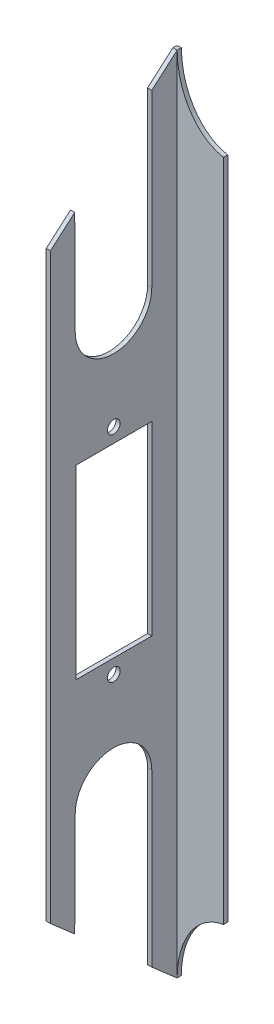
ISO-10303-21;
HEADER;
FILE_DESCRIPTION(('STEP AP214'),'2;1');
FILE_NAME('part.step','',(''),(''),'','','');
FILE_SCHEMA(('AUTOMOTIVE_DESIGN { 1 0 10303 214 1 1 1 1 }'));
ENDSEC;
DATA;
#1=APPLICATION_CONTEXT('core data for automotive mechanical design processes');
#2=APPLICATION_PROTOCOL_DEFINITION('international standard','automotive_design',2000,#1);
#3=PRODUCT_CONTEXT('',#1,'mechanical');
#4=PRODUCT('Part','Part','',(#3));
#5=PRODUCT_RELATED_PRODUCT_CATEGORY('part','',(#4));
#6=PRODUCT_DEFINITION_FORMATION('','',#4);
#7=PRODUCT_DEFINITION_CONTEXT('part definition',#1,'design');
#8=PRODUCT_DEFINITION('design','',#6,#7);
#9=PRODUCT_DEFINITION_SHAPE('','',#8);
#10=(LENGTH_UNIT() NAMED_UNIT(*) SI_UNIT(.MILLI.,.METRE.));
#11=(NAMED_UNIT(*) PLANE_ANGLE_UNIT() SI_UNIT($,.RADIAN.));
#12=(NAMED_UNIT(*) SI_UNIT($,.STERADIAN.) SOLID_ANGLE_UNIT());
#13=UNCERTAINTY_MEASURE_WITH_UNIT(LENGTH_MEASURE(1.E-05),#10,'distance_accuracy_value','');
#14=(GEOMETRIC_REPRESENTATION_CONTEXT(3) GLOBAL_UNCERTAINTY_ASSIGNED_CONTEXT((#13)) GLOBAL_UNIT_ASSIGNED_CONTEXT((#10,
#11,#12)) REPRESENTATION_CONTEXT('',''));
#15=CARTESIAN_POINT('',(0.,0.,0.));
#16=DIRECTION('',(0.,0.,1.));
#17=DIRECTION('',(1.,0.,0.));
#18=AXIS2_PLACEMENT_3D('',#15,#16,#17);
#19=CARTESIAN_POINT('',(906.5,-613.964402389266,535.434071851104));
#20=DIRECTION('',(0.,-0.753661415709483,0.65726286253734));
#21=DIRECTION('',(0.,-0.65726286253734,-0.753661415709483));
#22=AXIS2_PLACEMENT_3D('',#19,#20,#21);
#23=PLANE('',#22);
#24=DIRECTION('',(0.,-0.65726286253734,-0.753661415709483));
#25=VECTOR('',#24,1.);
#26=CARTESIAN_POINT('',(906.5,-613.964402389266,535.434071851104));
#27=LINE('',#26,#25);
#28=CARTESIAN_POINT('',(906.5,-68.9811056315042,1160.34825213334));
#29=VERTEX_POINT('',#28);
#30=CARTESIAN_POINT('',(906.5,-73.9946501548774,1154.59938774655));
#31=VERTEX_POINT('',#30);
#32=EDGE_CURVE('E277',#29,#31,#27,.T.);
#33=ORIENTED_EDGE('',*,*,#32,.T.);
#34=DIRECTION('',(-1.,0.,0.));
#35=VECTOR('',#34,1.);
#36=CARTESIAN_POINT('',(907.5,-73.9946501548774,1154.59938774655));
#37=LINE('',#36,#35);
#38=CARTESIAN_POINT('',(907.5,-73.9946501548652,1154.59938774655));
#39=VERTEX_POINT('',#38);
#40=EDGE_CURVE('E200',#39,#31,#37,.T.);
#41=ORIENTED_EDGE('',*,*,#40,.F.);
#42=DIRECTION('',(0.,-0.65726286253734,-0.753661415709483));
#43=VECTOR('',#42,1.);
#44=CARTESIAN_POINT('',(907.5,-613.964402389266,535.434071851104));
#45=LINE('',#44,#43);
#46=CARTESIAN_POINT('',(907.5,-68.9811056315042,1160.34825213334));
#47=VERTEX_POINT('',#46);
#48=EDGE_CURVE('E214',#47,#39,#45,.T.);
#49=ORIENTED_EDGE('',*,*,#48,.F.);
#50=DIRECTION('',(1.,0.,0.));
#51=VECTOR('',#50,1.);
#52=CARTESIAN_POINT('',(906.5,-68.9811056315042,1160.34825213334));
#53=LINE('',#52,#51);
#54=EDGE_CURVE('E265',#29,#47,#53,.T.);
#55=ORIENTED_EDGE('',*,*,#54,.F.);
#56=EDGE_LOOP('',(#33,#41,#49,#55));
#57=FACE_BOUND('',#56,.T.);
#58=ADVANCED_FACE('F41',(#57),#23,.T.);
#59=CARTESIAN_POINT('',(906.5,613.964402389274,535.434071851114));
#60=DIRECTION('',(0.,-0.753661415709481,-0.657262862537342));
#61=DIRECTION('',(0.,0.657262862537342,-0.753661415709481));
#62=AXIS2_PLACEMENT_3D('',#59,#60,#61);
#63=PLANE('',#62);
#64=DIRECTION('',(-1.,0.,0.));
#65=VECTOR('',#64,1.);
#66=CARTESIAN_POINT('',(907.5,89.911338189656,1136.34825213334));
#67=LINE('',#66,#65);
#68=CARTESIAN_POINT('',(907.5,89.911338189656,1136.34825213334));
#69=VERTEX_POINT('',#68);
#70=CARTESIAN_POINT('',(906.5,89.911338189656,1136.34825213334));
#71=VERTEX_POINT('',#70);
#72=EDGE_CURVE('E598',#69,#71,#67,.T.);
#73=ORIENTED_EDGE('',*,*,#72,.F.);
#74=DIRECTION('',(0.,0.657262862537342,-0.753661415709481));
#75=VECTOR('',#74,1.);
#76=CARTESIAN_POINT('',(907.5,613.964402389274,535.434071851114));
#77=LINE('',#76,#75);
#78=CARTESIAN_POINT('',(907.5,95.1438963291906,1130.34825213334));
#79=VERTEX_POINT('',#78);
#80=EDGE_CURVE('E227',#69,#79,#77,.T.);
#81=ORIENTED_EDGE('',*,*,#80,.T.);
#82=DIRECTION('',(1.,0.,0.));
#83=VECTOR('',#82,1.);
#84=CARTESIAN_POINT('',(906.5,95.1438963291911,1130.34825213334));
#85=LINE('',#84,#83);
#86=CARTESIAN_POINT('',(906.5,95.1438963291911,1130.34825213334));
#87=VERTEX_POINT('',#86);
#88=EDGE_CURVE('E260',#87,#79,#85,.T.);
#89=ORIENTED_EDGE('',*,*,#88,.F.);
#90=DIRECTION('',(0.,0.657262862537342,-0.753661415709481));
#91=VECTOR('',#90,1.);
#92=CARTESIAN_POINT('',(906.5,613.964402389274,535.434071851114));
#93=LINE('',#92,#91);
#94=EDGE_CURVE('E283',#71,#87,#93,.T.);
#95=ORIENTED_EDGE('',*,*,#94,.F.);
#96=EDGE_LOOP('',(#73,#81,#89,#95));
#97=FACE_BOUND('',#96,.T.);
#98=ADVANCED_FACE('F338',(#97),#63,.F.);
#99=CARTESIAN_POINT('',(906.5,0.,0.));
#100=DIRECTION('',(-1.,0.,0.));
#101=DIRECTION('',(0.,0.,1.));
#102=AXIS2_PLACEMENT_3D('',#99,#100,#101);
#103=PLANE('',#102);
#104=DIRECTION('',(0.,-1.,0.));
#105=VECTOR('',#104,1.);
#106=CARTESIAN_POINT('',(906.5,0.,1136.34825213334));
#107=LINE('',#106,#105);
#108=CARTESIAN_POINT('',(906.5,-49.4661870834936,1136.34825213334));
#109=VERTEX_POINT('',#108);
#110=CARTESIAN_POINT('',(906.5,-89.911338189656,1136.34825213334));
#111=VERTEX_POINT('',#110);
#112=EDGE_CURVE('E196',#109,#111,#107,.T.);
#113=ORIENTED_EDGE('',*,*,#112,.F.);
#114=CARTESIAN_POINT('',(906.5,-49.4661870834936,1145.41453048203));
#115=DIRECTION('',(1.,0.,0.));
#116=DIRECTION('',(0.,0.,1.));
#117=AXIS2_PLACEMENT_3D('',#114,#115,#116);
#118=CIRCLE('',#117,9.06627834869233);
#119=CARTESIAN_POINT('',(906.5,-49.4223972165044,1154.4807030782));
#120=VERTEX_POINT('',#119);
#121=EDGE_CURVE('E208',#109,#120,#118,.T.);
#122=ORIENTED_EDGE('',*,*,#121,.T.);
#123=DIRECTION('',(0.,-0.999988335619117,0.00482997160522153));
#124=VECTOR('',#123,1.);
#125=CARTESIAN_POINT('',(906.5,5.57489101617828,1154.21506463916));
#126=LINE('',#125,#124);
#127=EDGE_CURVE('E734',#120,#31,#126,.T.);
#128=ORIENTED_EDGE('',*,*,#127,.T.);
#129=ORIENTED_EDGE('',*,*,#32,.F.);
#130=DIRECTION('',(0.,-1.,0.));
#131=VECTOR('',#130,1.);
#132=CARTESIAN_POINT('',(906.5,0.,1160.34825213334));
#133=LINE('',#132,#131);
#134=CARTESIAN_POINT('',(906.5,68.9811056315166,1160.34825213334));
#135=VERTEX_POINT('',#134);
#136=EDGE_CURVE('E280',#135,#29,#133,.T.);
#137=ORIENTED_EDGE('',*,*,#136,.F.);
#138=CARTESIAN_POINT('',(906.5,73.9946501548774,1154.59938774655));
#139=VERTEX_POINT('',#138);
#140=EDGE_CURVE('E284',#135,#139,#93,.T.);
#141=ORIENTED_EDGE('',*,*,#140,.T.);
#142=DIRECTION('',(0.,0.999988335619117,0.00482997160522153));
#143=VECTOR('',#142,1.);
#144=CARTESIAN_POINT('',(906.5,-5.57489101617828,1154.21506463916));
#145=LINE('',#144,#143);
#146=CARTESIAN_POINT('',(906.5,49.4223972165044,1154.4807030782));
#147=VERTEX_POINT('',#146);
#148=EDGE_CURVE('E713',#147,#139,#145,.T.);
#149=ORIENTED_EDGE('',*,*,#148,.F.);
#150=CARTESIAN_POINT('',(906.5,49.4661870834936,1145.41453048203));
#151=DIRECTION('',(-1.,0.,0.));
#152=DIRECTION('',(0.,0.,1.));
#153=AXIS2_PLACEMENT_3D('',#150,#151,#152);
#154=CIRCLE('',#153,9.06627834869233);
#155=CARTESIAN_POINT('',(906.5,49.4661870834936,1136.34825213334));
#156=VERTEX_POINT('',#155);
#157=EDGE_CURVE('E716',#156,#147,#154,.T.);
#158=ORIENTED_EDGE('',*,*,#157,.F.);
#159=DIRECTION('',(0.,1.,0.));
#160=VECTOR('',#159,1.);
#161=CARTESIAN_POINT('',(906.5,0.,1136.34825213334));
#162=LINE('',#161,#160);
#163=EDGE_CURVE('E719',#156,#71,#162,.T.);
#164=ORIENTED_EDGE('',*,*,#163,.T.);
#165=ORIENTED_EDGE('',*,*,#94,.T.);
#166=DIRECTION('',(0.,0.,1.));
#167=VECTOR('',#166,1.);
#168=CARTESIAN_POINT('',(906.5,95.1438963291906,1129.34825213334));
#169=LINE('',#168,#167);
#170=CARTESIAN_POINT('',(906.5,95.1438963291906,1129.84825213334));
#171=VERTEX_POINT('',#170);
#172=EDGE_CURVE('E628',#171,#87,#169,.T.);
#173=ORIENTED_EDGE('',*,*,#172,.F.);
#174=CARTESIAN_POINT('',(906.5,-104.658285962047,1129.84825213334));
#175=CARTESIAN_POINT('',(906.5,-34.8860953206626,1129.84825213334));
#176=CARTESIAN_POINT('',(906.5,34.8860953207221,1129.84825213334));
#177=CARTESIAN_POINT('',(906.5,104.658285962107,1129.84825213334));
#178=(BOUNDED_CURVE() B_SPLINE_CURVE(3,(#174,#175,#176,#177),.UNSPECIFIED.,.F.,
.F.) B_SPLINE_CURVE_WITH_KNOTS((4,4),(-0.198966238765806,0.0103503331583482),
.UNSPECIFIED.) CURVE() GEOMETRIC_REPRESENTATION_ITEM() RATIONAL_B_SPLINE_CURVE((1.,1.,1.,1.)) REPRESENTATION_ITEM(''));
#179=CARTESIAN_POINT('',(906.500000000001,-95.1438963291312,1129.84825213334));
#180=VERTEX_POINT('',#179);
#181=EDGE_CURVE('E55',#171,#180,#178,.F.);
#182=ORIENTED_EDGE('',*,*,#181,.T.);
#183=DIRECTION('',(0.,9.55069356933896E-11,-1.));
#184=VECTOR('',#183,1.);
#185=CARTESIAN_POINT('',(906.500000000001,-95.1438963291789,1130.34825213334));
#186=LINE('',#185,#184);
#187=CARTESIAN_POINT('',(906.5,-95.1438963291784,1130.34825213334));
#188=VERTEX_POINT('',#187);
#189=EDGE_CURVE('E624',#188,#180,#186,.T.);
#190=ORIENTED_EDGE('',*,*,#189,.F.);
#191=EDGE_CURVE('E249',#111,#188,#27,.T.);
#192=ORIENTED_EDGE('',*,*,#191,.F.);
#193=EDGE_LOOP('',(#113,#122,#128,#129,#137,#141,#149,#158,#164,#165,#173,#182,#190,#192));
#194=FACE_BOUND('',#193,.T.);
#195=CARTESIAN_POINT('',(906.5,-25.3999999999899,1145.34825213334));
#196=DIRECTION('',(-1.,0.,0.));
#197=DIRECTION('',(0.,0.,1.));
#198=AXIS2_PLACEMENT_3D('',#195,#196,#197);
#199=CIRCLE('',#198,1.50000000000008);
#200=CARTESIAN_POINT('',(906.5,-25.3999999999899,1146.84825213334));
#201=VERTEX_POINT('',#200);
#202=EDGE_CURVE('E287',#201,#201,#199,.T.);
#203=ORIENTED_EDGE('',*,*,#202,.F.);
#204=EDGE_LOOP('',(#203));
#205=FACE_BOUND('',#204,.T.);
#206=CARTESIAN_POINT('',(906.5,25.4000000000101,1145.34825213334));
#207=DIRECTION('',(-1.,0.,0.));
#208=DIRECTION('',(0.,0.,1.));
#209=AXIS2_PLACEMENT_3D('',#206,#207,#208);
#210=CIRCLE('',#209,1.50000000000008);
#211=CARTESIAN_POINT('',(906.5,25.4000000000101,1146.84825213334));
#212=VERTEX_POINT('',#211);
#213=EDGE_CURVE('E290',#212,#212,#210,.T.);
#214=ORIENTED_EDGE('',*,*,#213,.F.);
#215=EDGE_LOOP('',(#214));
#216=FACE_BOUND('',#215,.T.);
#217=DIRECTION('',(0.,-1.,0.));
#218=VECTOR('',#217,1.);
#219=CARTESIAN_POINT('',(906.5,0.,1136.34825213334));
#220=LINE('',#219,#218);
#221=CARTESIAN_POINT('',(906.5,22.0000000000101,1136.34825213334));
#222=VERTEX_POINT('',#221);
#223=CARTESIAN_POINT('',(906.5,-21.9999999999899,1136.34825213334));
#224=VERTEX_POINT('',#223);
#225=EDGE_CURVE('E293',#222,#224,#220,.T.);
#226=ORIENTED_EDGE('',*,*,#225,.F.);
#227=DIRECTION('',(0.,0.,-1.));
#228=VECTOR('',#227,1.);
#229=CARTESIAN_POINT('',(906.5,22.0000000000098,0.));
#230=LINE('',#229,#228);
#231=CARTESIAN_POINT('',(906.5,22.0000000000101,1154.34825213334));
#232=VERTEX_POINT('',#231);
#233=EDGE_CURVE('E296',#232,#222,#230,.T.);
#234=ORIENTED_EDGE('',*,*,#233,.F.);
#235=DIRECTION('',(0.,-1.,0.));
#236=VECTOR('',#235,1.);
#237=CARTESIAN_POINT('',(906.5,0.,1154.34825213334));
#238=LINE('',#237,#236);
#239=CARTESIAN_POINT('',(906.5,-21.9999999999899,1154.34825213334));
#240=VERTEX_POINT('',#239);
#241=EDGE_CURVE('E298',#232,#240,#238,.T.);
#242=ORIENTED_EDGE('',*,*,#241,.T.);
#243=DIRECTION('',(0.,0.,-1.));
#244=VECTOR('',#243,1.);
#245=CARTESIAN_POINT('',(906.5,-21.9999999999899,0.));
#246=LINE('',#245,#244);
#247=EDGE_CURVE('E223',#240,#224,#246,.T.);
#248=ORIENTED_EDGE('',*,*,#247,.T.);
#249=EDGE_LOOP('',(#226,#234,#242,#248));
#250=FACE_BOUND('',#249,.T.);
#251=ADVANCED_FACE('F306',(#194,#205,#216,#250),#103,.T.);
#252=CARTESIAN_POINT('',(907.5,0.,0.));
#253=DIRECTION('',(-1.,0.,0.));
#254=DIRECTION('',(0.,0.,1.));
#255=AXIS2_PLACEMENT_3D('',#252,#253,#254);
#256=PLANE('',#255);
#257=DIRECTION('',(0.,-1.,0.));
#258=VECTOR('',#257,1.);
#259=CARTESIAN_POINT('',(907.5,0.,1136.34825213334));
#260=LINE('',#259,#258);
#261=CARTESIAN_POINT('',(907.5,22.0000000000101,1136.34825213334));
#262=VERTEX_POINT('',#261);
#263=CARTESIAN_POINT('',(907.5,-21.9999999999899,1136.34825213334));
#264=VERTEX_POINT('',#263);
#265=EDGE_CURVE('E237',#262,#264,#260,.T.);
#266=ORIENTED_EDGE('',*,*,#265,.T.);
#267=DIRECTION('',(0.,0.,-1.));
#268=VECTOR('',#267,1.);
#269=CARTESIAN_POINT('',(907.5,-21.9999999999899,0.));
#270=LINE('',#269,#268);
#271=CARTESIAN_POINT('',(907.5,-21.9999999999899,1154.34825213334));
#272=VERTEX_POINT('',#271);
#273=EDGE_CURVE('E246',#272,#264,#270,.T.);
#274=ORIENTED_EDGE('',*,*,#273,.F.);
#275=DIRECTION('',(0.,-1.,0.));
#276=VECTOR('',#275,1.);
#277=CARTESIAN_POINT('',(907.5,0.,1154.34825213334));
#278=LINE('',#277,#276);
#279=CARTESIAN_POINT('',(907.5,22.0000000000101,1154.34825213334));
#280=VERTEX_POINT('',#279);
#281=EDGE_CURVE('E243',#280,#272,#278,.T.);
#282=ORIENTED_EDGE('',*,*,#281,.F.);
#283=DIRECTION('',(0.,0.,-1.));
#284=VECTOR('',#283,1.);
#285=CARTESIAN_POINT('',(907.5,22.0000000000098,0.));
#286=LINE('',#285,#284);
#287=EDGE_CURVE('E240',#280,#262,#286,.T.);
#288=ORIENTED_EDGE('',*,*,#287,.T.);
#289=EDGE_LOOP('',(#266,#274,#282,#288));
#290=FACE_BOUND('',#289,.T.);
#291=CARTESIAN_POINT('',(907.5,25.4000000000101,1145.34825213334));
#292=DIRECTION('',(-1.,0.,0.));
#293=DIRECTION('',(0.,0.,1.));
#294=AXIS2_PLACEMENT_3D('',#291,#292,#293);
#295=CIRCLE('',#294,1.50000000000008);
#296=CARTESIAN_POINT('',(907.5,25.4000000000101,1146.84825213334));
#297=VERTEX_POINT('',#296);
#298=EDGE_CURVE('E234',#297,#297,#295,.T.);
#299=ORIENTED_EDGE('',*,*,#298,.T.);
#300=EDGE_LOOP('',(#299));
#301=FACE_BOUND('',#300,.T.);
#302=CARTESIAN_POINT('',(907.5,-25.3999999999899,1145.34825213334));
#303=DIRECTION('',(-1.,0.,0.));
#304=DIRECTION('',(0.,0.,1.));
#305=AXIS2_PLACEMENT_3D('',#302,#303,#304);
#306=CIRCLE('',#305,1.50000000000008);
#307=CARTESIAN_POINT('',(907.5,-25.3999999999899,1146.84825213334));
#308=VERTEX_POINT('',#307);
#309=EDGE_CURVE('E231',#308,#308,#306,.T.);
#310=ORIENTED_EDGE('',*,*,#309,.T.);
#311=EDGE_LOOP('',(#310));
#312=FACE_BOUND('',#311,.T.);
#313=CARTESIAN_POINT('',(907.5,-49.4661870834936,1145.41453048203));
#314=DIRECTION('',(1.,0.,0.));
#315=DIRECTION('',(0.,0.,1.));
#316=AXIS2_PLACEMENT_3D('',#313,#314,#315);
#317=CIRCLE('',#316,9.06627834869233);
#318=CARTESIAN_POINT('',(907.5,-49.4661870834936,1136.34825213334));
#319=VERTEX_POINT('',#318);
#320=CARTESIAN_POINT('',(907.5,-49.4223972165044,1154.4807030782));
#321=VERTEX_POINT('',#320);
#322=EDGE_CURVE('E201',#319,#321,#317,.T.);
#323=ORIENTED_EDGE('',*,*,#322,.F.);
#324=DIRECTION('',(0.,-1.,0.));
#325=VECTOR('',#324,1.);
#326=CARTESIAN_POINT('',(907.5,0.,1136.34825213334));
#327=LINE('',#326,#325);
#328=CARTESIAN_POINT('',(907.5,-89.911338189656,1136.34825213334));
#329=VERTEX_POINT('',#328);
#330=EDGE_CURVE('E193',#319,#329,#327,.T.);
#331=ORIENTED_EDGE('',*,*,#330,.T.);
#332=CARTESIAN_POINT('',(907.5,-95.1438963291784,1130.34825213334));
#333=VERTEX_POINT('',#332);
#334=EDGE_CURVE('E206',#329,#333,#45,.T.);
#335=ORIENTED_EDGE('',*,*,#334,.T.);
#336=DIRECTION('',(0.,1.,0.));
#337=VECTOR('',#336,1.);
#338=CARTESIAN_POINT('',(907.5,95.1438963291911,1130.34825213334));
#339=LINE('',#338,#337);
#340=EDGE_CURVE('E608',#333,#79,#339,.T.);
#341=ORIENTED_EDGE('',*,*,#340,.T.);
#342=ORIENTED_EDGE('',*,*,#80,.F.);
#343=DIRECTION('',(0.,1.,0.));
#344=VECTOR('',#343,1.);
#345=CARTESIAN_POINT('',(907.5,0.,1136.34825213334));
#346=LINE('',#345,#344);
#347=CARTESIAN_POINT('',(907.5,49.4661870834936,1136.34825213334));
#348=VERTEX_POINT('',#347);
#349=EDGE_CURVE('E715',#348,#69,#346,.T.);
#350=ORIENTED_EDGE('',*,*,#349,.F.);
#351=CARTESIAN_POINT('',(907.5,49.4661870834936,1145.41453048203));
#352=DIRECTION('',(-1.,0.,0.));
#353=DIRECTION('',(0.,0.,1.));
#354=AXIS2_PLACEMENT_3D('',#351,#352,#353);
#355=CIRCLE('',#354,9.06627834869233);
#356=CARTESIAN_POINT('',(907.5,49.4223972165044,1154.4807030782));
#357=VERTEX_POINT('',#356);
#358=EDGE_CURVE('E724',#348,#357,#355,.T.);
#359=ORIENTED_EDGE('',*,*,#358,.T.);
#360=DIRECTION('',(0.,0.999988335619117,0.00482997160522153));
#361=VECTOR('',#360,1.);
#362=CARTESIAN_POINT('',(907.5,-5.57489101617828,1154.21506463916));
#363=LINE('',#362,#361);
#364=CARTESIAN_POINT('',(907.5,73.9946501548774,1154.59938774655));
#365=VERTEX_POINT('',#364);
#366=EDGE_CURVE('E70',#357,#365,#363,.T.);
#367=ORIENTED_EDGE('',*,*,#366,.T.);
#368=CARTESIAN_POINT('',(907.5,68.9811056315166,1160.34825213334));
#369=VERTEX_POINT('',#368);
#370=EDGE_CURVE('E228',#369,#365,#77,.T.);
#371=ORIENTED_EDGE('',*,*,#370,.F.);
#372=DIRECTION('',(0.,-1.,0.));
#373=VECTOR('',#372,1.);
#374=CARTESIAN_POINT('',(907.5,0.,1160.34825213334));
#375=LINE('',#374,#373);
#376=EDGE_CURVE('E218',#369,#47,#375,.T.);
#377=ORIENTED_EDGE('',*,*,#376,.T.);
#378=ORIENTED_EDGE('',*,*,#48,.T.);
#379=DIRECTION('',(0.,-0.999988335619117,0.00482997160522153));
#380=VECTOR('',#379,1.);
#381=CARTESIAN_POINT('',(907.5,5.57489101617828,1154.21506463916));
#382=LINE('',#381,#380);
#383=EDGE_CURVE('E62',#321,#39,#382,.T.);
#384=ORIENTED_EDGE('',*,*,#383,.F.);
#385=EDGE_LOOP('',(#323,#331,#335,#341,#342,#350,#359,#367,#371,#377,#378,#384));
#386=FACE_BOUND('',#385,.T.);
#387=ADVANCED_FACE('F204',(#290,#301,#312,#386),#256,.F.);
#388=CARTESIAN_POINT('',(906.5,0.,1136.34825213334));
#389=DIRECTION('',(0.,0.,1.));
#390=DIRECTION('',(1.,0.,0.));
#391=AXIS2_PLACEMENT_3D('',#388,#389,#390);
#392=PLANE('',#391);
#393=ORIENTED_EDGE('',*,*,#265,.F.);
#394=DIRECTION('',(1.,0.,0.));
#395=VECTOR('',#394,1.);
#396=CARTESIAN_POINT('',(906.5,22.0000000000101,1136.34825213334));
#397=LINE('',#396,#395);
#398=EDGE_CURVE('E257',#222,#262,#397,.T.);
#399=ORIENTED_EDGE('',*,*,#398,.F.);
#400=ORIENTED_EDGE('',*,*,#225,.T.);
#401=DIRECTION('',(1.,0.,0.));
#402=VECTOR('',#401,1.);
#403=CARTESIAN_POINT('',(906.5,-21.9999999999899,1136.34825213334));
#404=LINE('',#403,#402);
#405=EDGE_CURVE('E250',#224,#264,#404,.T.);
#406=ORIENTED_EDGE('',*,*,#405,.T.);
#407=EDGE_LOOP('',(#393,#399,#400,#406));
#408=FACE_BOUND('',#407,.T.);
#409=ADVANCED_FACE('F311',(#408),#392,.T.);
#410=CARTESIAN_POINT('',(906.5,22.0000000000098,0.));
#411=DIRECTION('',(0.,-1.,0.));
#412=DIRECTION('',(0.,0.,-1.));
#413=AXIS2_PLACEMENT_3D('',#410,#411,#412);
#414=PLANE('',#413);
#415=ORIENTED_EDGE('',*,*,#287,.F.);
#416=DIRECTION('',(1.,0.,0.));
#417=VECTOR('',#416,1.);
#418=CARTESIAN_POINT('',(906.5,22.0000000000101,1154.34825213334));
#419=LINE('',#418,#417);
#420=EDGE_CURVE('E255',#232,#280,#419,.T.);
#421=ORIENTED_EDGE('',*,*,#420,.F.);
#422=ORIENTED_EDGE('',*,*,#233,.T.);
#423=ORIENTED_EDGE('',*,*,#398,.T.);
#424=EDGE_LOOP('',(#415,#421,#422,#423));
#425=FACE_BOUND('',#424,.T.);
#426=ADVANCED_FACE('F314',(#425),#414,.T.);
#427=CARTESIAN_POINT('',(906.5,0.,1154.34825213334));
#428=DIRECTION('',(0.,0.,1.));
#429=DIRECTION('',(1.,0.,0.));
#430=AXIS2_PLACEMENT_3D('',#427,#428,#429);
#431=PLANE('',#430);
#432=ORIENTED_EDGE('',*,*,#281,.T.);
#433=DIRECTION('',(1.,0.,0.));
#434=VECTOR('',#433,1.);
#435=CARTESIAN_POINT('',(906.5,-21.9999999999899,1154.34825213334));
#436=LINE('',#435,#434);
#437=EDGE_CURVE('E252',#240,#272,#436,.T.);
#438=ORIENTED_EDGE('',*,*,#437,.F.);
#439=ORIENTED_EDGE('',*,*,#241,.F.);
#440=ORIENTED_EDGE('',*,*,#420,.T.);
#441=EDGE_LOOP('',(#432,#438,#439,#440));
#442=FACE_BOUND('',#441,.T.);
#443=ADVANCED_FACE('F317',(#442),#431,.F.);
#444=DIRECTION('',(-1.,0.,0.));
#445=VECTOR('',#444,1.);
#446=CARTESIAN_POINT('',(907.5,-89.911338189656,1136.34825213334));
#447=LINE('',#446,#445);
#448=EDGE_CURVE('E190',#329,#111,#447,.T.);
#449=ORIENTED_EDGE('',*,*,#448,.T.);
#450=ORIENTED_EDGE('',*,*,#191,.T.);
#451=DIRECTION('',(1.,0.,0.));
#452=VECTOR('',#451,1.);
#453=CARTESIAN_POINT('',(906.5,-95.1438963291784,1130.34825213334));
#454=LINE('',#453,#452);
#455=EDGE_CURVE('E212',#188,#333,#454,.T.);
#456=ORIENTED_EDGE('',*,*,#455,.T.);
#457=ORIENTED_EDGE('',*,*,#334,.F.);
#458=EDGE_LOOP('',(#449,#450,#456,#457));
#459=FACE_BOUND('',#458,.T.);
#460=ADVANCED_FACE('F210',(#459),#23,.T.);
#461=CARTESIAN_POINT('',(906.5,0.,1160.34825213334));
#462=DIRECTION('',(0.,0.,1.));
#463=DIRECTION('',(1.,0.,0.));
#464=AXIS2_PLACEMENT_3D('',#461,#462,#463);
#465=PLANE('',#464);
#466=ORIENTED_EDGE('',*,*,#376,.F.);
#467=DIRECTION('',(1.,0.,0.));
#468=VECTOR('',#467,1.);
#469=CARTESIAN_POINT('',(906.5,68.9811056315166,1160.34825213334));
#470=LINE('',#469,#468);
#471=EDGE_CURVE('E263',#135,#369,#470,.T.);
#472=ORIENTED_EDGE('',*,*,#471,.F.);
#473=ORIENTED_EDGE('',*,*,#136,.T.);
#474=ORIENTED_EDGE('',*,*,#54,.T.);
#475=EDGE_LOOP('',(#466,#472,#473,#474));
#476=FACE_BOUND('',#475,.T.);
#477=ADVANCED_FACE('F339',(#476),#465,.T.);
#478=CARTESIAN_POINT('',(906.5,25.4000000000101,1145.34825213334));
#479=DIRECTION('',(1.,0.,0.));
#480=DIRECTION('',(0.,1.,0.));
#481=AXIS2_PLACEMENT_3D('',#478,#479,#480);
#482=CYLINDRICAL_SURFACE('',#481,1.50000000000008);
#483=ORIENTED_EDGE('',*,*,#213,.T.);
#484=EDGE_LOOP('',(#483));
#485=FACE_BOUND('',#484,.T.);
#486=ORIENTED_EDGE('',*,*,#298,.F.);
#487=EDGE_LOOP('',(#486));
#488=FACE_BOUND('',#487,.T.);
#489=ADVANCED_FACE('F329',(#485,#488),#482,.F.);
#490=CARTESIAN_POINT('',(906.5,-25.3999999999899,1145.34825213334));
#491=DIRECTION('',(1.,0.,0.));
#492=DIRECTION('',(0.,1.,0.));
#493=AXIS2_PLACEMENT_3D('',#490,#491,#492);
#494=CYLINDRICAL_SURFACE('',#493,1.50000000000008);
#495=ORIENTED_EDGE('',*,*,#202,.T.);
#496=EDGE_LOOP('',(#495));
#497=FACE_BOUND('',#496,.T.);
#498=ORIENTED_EDGE('',*,*,#309,.F.);
#499=EDGE_LOOP('',(#498));
#500=FACE_BOUND('',#499,.T.);
#501=ADVANCED_FACE('F326',(#497,#500),#494,.F.);
#502=ORIENTED_EDGE('',*,*,#370,.T.);
#503=DIRECTION('',(-1.,0.,0.));
#504=VECTOR('',#503,1.);
#505=CARTESIAN_POINT('',(907.5,73.9946501548774,1154.59938774655));
#506=LINE('',#505,#504);
#507=EDGE_CURVE('E709',#365,#139,#506,.T.);
#508=ORIENTED_EDGE('',*,*,#507,.T.);
#509=ORIENTED_EDGE('',*,*,#140,.F.);
#510=ORIENTED_EDGE('',*,*,#471,.T.);
#511=EDGE_LOOP('',(#502,#508,#509,#510));
#512=FACE_BOUND('',#511,.T.);
#513=ADVANCED_FACE('F328',(#512),#63,.F.);
#514=CARTESIAN_POINT('',(906.5,-21.9999999999899,0.));
#515=DIRECTION('',(0.,-1.,0.));
#516=DIRECTION('',(1.,0.,0.));
#517=AXIS2_PLACEMENT_3D('',#514,#515,#516);
#518=PLANE('',#517);
#519=ORIENTED_EDGE('',*,*,#273,.T.);
#520=ORIENTED_EDGE('',*,*,#405,.F.);
#521=ORIENTED_EDGE('',*,*,#247,.F.);
#522=ORIENTED_EDGE('',*,*,#437,.T.);
#523=EDGE_LOOP('',(#519,#520,#521,#522));
#524=FACE_BOUND('',#523,.T.);
#525=ADVANCED_FACE('F308',(#524),#518,.F.);
#526=CARTESIAN_POINT('',(906.5,95.1438963291906,1129.34825213334));
#527=DIRECTION('',(0.,1.,0.));
#528=DIRECTION('',(-1.,0.,0.));
#529=AXIS2_PLACEMENT_3D('',#526,#527,#528);
#530=PLANE('',#529);
#531=DIRECTION('',(1.,0.,0.));
#532=VECTOR('',#531,1.);
#533=CARTESIAN_POINT('',(906.5,95.1438963291906,1129.34825213334));
#534=LINE('',#533,#532);
#535=CARTESIAN_POINT('',(907.,95.1438963291906,1129.34825213334));
#536=VERTEX_POINT('',#535);
#537=CARTESIAN_POINT('',(907.5,95.1438963291906,1129.34825213334));
#538=VERTEX_POINT('',#537);
#539=EDGE_CURVE('E215',#536,#538,#534,.T.);
#540=ORIENTED_EDGE('',*,*,#539,.F.);
#541=CARTESIAN_POINT('',(906.5,95.1438963291906,1129.84825213334));
#542=CARTESIAN_POINT('',(906.5,95.1438963291907,1129.34825213334));
#543=CARTESIAN_POINT('',(907.,95.1438963291906,1129.34825213334));
#544=(BOUNDED_CURVE() B_SPLINE_CURVE(2,(#541,#542,#543),.UNSPECIFIED.,.F.,
.F.) B_SPLINE_CURVE_WITH_KNOTS((3,3),(0.,1.),
.UNSPECIFIED.) CURVE() GEOMETRIC_REPRESENTATION_ITEM() RATIONAL_B_SPLINE_CURVE((1.,
0.70710678118647,1.)) REPRESENTATION_ITEM(''));
#545=EDGE_CURVE('E658',#536,#171,#544,.F.);
#546=ORIENTED_EDGE('',*,*,#545,.T.);
#547=ORIENTED_EDGE('',*,*,#172,.T.);
#548=ORIENTED_EDGE('',*,*,#88,.T.);
#549=DIRECTION('',(0.,0.,1.));
#550=VECTOR('',#549,1.);
#551=CARTESIAN_POINT('',(907.5,95.1438963291906,1129.34825213334));
#552=LINE('',#551,#550);
#553=EDGE_CURVE('E273',#538,#79,#552,.T.);
#554=ORIENTED_EDGE('',*,*,#553,.F.);
#555=EDGE_LOOP('',(#540,#546,#547,#548,#554));
#556=FACE_BOUND('',#555,.T.);
#557=ADVANCED_FACE('F404',(#556),#530,.T.);
#558=CARTESIAN_POINT('',(906.5,94.3079528037585,1129.34825213334));
#559=DIRECTION('',(0.,0.,-1.));
#560=DIRECTION('',(-1.,0.,0.));
#561=AXIS2_PLACEMENT_3D('',#558,#559,#560);
#562=PLANE('',#561);
#563=DIRECTION('',(1.,0.,0.));
#564=VECTOR('',#563,1.);
#565=CARTESIAN_POINT('',(906.500000000001,-95.1438963290834,1129.34825213334));
#566=LINE('',#565,#564);
#567=CARTESIAN_POINT('',(907.,-95.1438963290834,1129.34825213334));
#568=VERTEX_POINT('',#567);
#569=CARTESIAN_POINT('',(907.500000000001,-95.1438963290834,1129.34825213334));
#570=VERTEX_POINT('',#569);
#571=EDGE_CURVE('E219',#568,#570,#566,.T.);
#572=ORIENTED_EDGE('',*,*,#571,.F.);
#573=CARTESIAN_POINT('',(907.,104.658285962107,1129.34825213334));
#574=CARTESIAN_POINT('',(907.,34.8860953207221,1129.34825213334));
#575=CARTESIAN_POINT('',(907.,-34.8860953206626,1129.34825213334));
#576=CARTESIAN_POINT('',(907.,-104.658285962047,1129.34825213334));
#577=(BOUNDED_CURVE() B_SPLINE_CURVE(3,(#573,#574,#575,#576),.UNSPECIFIED.,.F.,
.F.) B_SPLINE_CURVE_WITH_KNOTS((4,4),(-0.198966238765806,0.0103503331583482),
.UNSPECIFIED.) CURVE() GEOMETRIC_REPRESENTATION_ITEM() RATIONAL_B_SPLINE_CURVE((1.,1.,1.,1.)) REPRESENTATION_ITEM(''));
#578=EDGE_CURVE('E259',#568,#536,#577,.F.);
#579=ORIENTED_EDGE('',*,*,#578,.T.);
#580=ORIENTED_EDGE('',*,*,#539,.T.);
#581=CARTESIAN_POINT('',(907.5,95.143896329286,1129.34825213334));
#582=CARTESIAN_POINT('',(907.499999999957,85.3427968572533,1129.34825213334));
#583=CARTESIAN_POINT('',(912.688679245255,79.6100782981252,1129.34825213334));
#584=CARTESIAN_POINT('',(918.499999999998,78.678049216256,1129.34825213334));
#585=(BOUNDED_CURVE() B_SPLINE_CURVE(3,(#581,#582,#583,#584),.UNSPECIFIED.,.F.,
.F.) B_SPLINE_CURVE_WITH_KNOTS((4,4),(0.528398684893041,0.750000000000713),
.UNSPECIFIED.) CURVE() GEOMETRIC_REPRESENTATION_ITEM() RATIONAL_B_SPLINE_CURVE((0.5,
0.499999999999157,0.630952380951514,0.89285714285707)) REPRESENTATION_ITEM(''));
#586=CARTESIAN_POINT('',(918.5,78.6780492162558,1129.34825213334));
#587=VERTEX_POINT('',#586);
#588=EDGE_CURVE('E613',#538,#587,#585,.T.);
#589=ORIENTED_EDGE('',*,*,#588,.T.);
#590=DIRECTION('',(0.,-1.,0.));
#591=VECTOR('',#590,1.);
#592=CARTESIAN_POINT('',(918.5,-78.6780492162429,1129.34825213334));
#593=LINE('',#592,#591);
#594=CARTESIAN_POINT('',(918.5,-78.6780492162428,1129.34825213334));
#595=VERTEX_POINT('',#594);
#596=EDGE_CURVE('E587',#587,#595,#593,.T.);
#597=ORIENTED_EDGE('',*,*,#596,.T.);
#598=CARTESIAN_POINT('',(918.5,-78.6780492162428,1129.34825213334));
#599=CARTESIAN_POINT('',(912.68867924531,-79.6100782981032,1129.34825213334));
#600=CARTESIAN_POINT('',(907.500000000043,-85.3427968571466,1129.34825213334));
#601=CARTESIAN_POINT('',(907.500000000001,-95.1438963290834,1129.34825213334));
#602=(BOUNDED_CURVE() B_SPLINE_CURVE(3,(#598,#599,#600,#601),.UNSPECIFIED.,.F.,
.F.) B_SPLINE_CURVE_WITH_KNOTS((4,4),(0.750000000000715,0.971601315106971),
.UNSPECIFIED.) CURVE() GEOMETRIC_REPRESENTATION_ITEM() RATIONAL_B_SPLINE_CURVE((0.892857142857113,
0.630952380953217,0.500000000000846,0.5)) REPRESENTATION_ITEM(''));
#603=EDGE_CURVE('E579',#595,#570,#602,.T.);
#604=ORIENTED_EDGE('',*,*,#603,.T.);
#605=EDGE_LOOP('',(#572,#579,#580,#589,#597,#604));
#606=FACE_BOUND('',#605,.T.);
#607=ADVANCED_FACE('F456',(#606),#562,.T.);
#608=CARTESIAN_POINT('',(906.500000000001,-95.1438963291789,1130.34825213334));
#609=DIRECTION('',(0.,-1.,-9.55069356933896E-11));
#610=DIRECTION('',(0.,9.55069356933896E-11,-1.));
#611=AXIS2_PLACEMENT_3D('',#608,#609,#610);
#612=PLANE('',#611);
#613=ORIENTED_EDGE('',*,*,#189,.T.);
#614=CARTESIAN_POINT('',(907.,-95.1438963291074,1129.34825213334));
#615=CARTESIAN_POINT('',(906.5,-95.1438963291074,1129.34825213334));
#616=CARTESIAN_POINT('',(906.5,-95.1438963291074,1129.84825213334));
#617=(BOUNDED_CURVE() B_SPLINE_CURVE(2,(#614,#615,#616),.UNSPECIFIED.,.F.,
.F.) B_SPLINE_CURVE_WITH_KNOTS((3,3),(0.,1.),
.UNSPECIFIED.) CURVE() GEOMETRIC_REPRESENTATION_ITEM() RATIONAL_B_SPLINE_CURVE((1.,
0.70710678118647,1.)) REPRESENTATION_ITEM(''));
#618=EDGE_CURVE('E12',#180,#568,#617,.F.);
#619=ORIENTED_EDGE('',*,*,#618,.T.);
#620=ORIENTED_EDGE('',*,*,#571,.T.);
#621=DIRECTION('',(0.,9.55069356933896E-11,-1.));
#622=VECTOR('',#621,1.);
#623=CARTESIAN_POINT('',(907.500000000001,-95.1438963291789,1130.34825213334));
#624=LINE('',#623,#622);
#625=EDGE_CURVE('E619',#333,#570,#624,.T.);
#626=ORIENTED_EDGE('',*,*,#625,.F.);
#627=ORIENTED_EDGE('',*,*,#455,.F.);
#628=EDGE_LOOP('',(#613,#619,#620,#626,#627));
#629=FACE_BOUND('',#628,.T.);
#630=ADVANCED_FACE('F415',(#629),#612,.T.);
#631=DIRECTION('',(0.,0.,1.));
#632=VECTOR('',#631,1.);
#633=SURFACE_OF_LINEAR_EXTRUSION('',#585,#632);
#634=CARTESIAN_POINT('',(907.5,95.143896329286,1130.34825213334));
#635=CARTESIAN_POINT('',(907.499999999957,85.3427968572533,1130.34825213334));
#636=CARTESIAN_POINT('',(912.688679245255,79.6100782981252,1130.34825213334));
#637=CARTESIAN_POINT('',(918.499999999998,78.678049216256,1130.34825213334));
#638=(BOUNDED_CURVE() B_SPLINE_CURVE(3,(#634,#635,#636,#637),.UNSPECIFIED.,.F.,
.F.) B_SPLINE_CURVE_WITH_KNOTS((4,4),(0.528398684893041,0.750000000000713),
.UNSPECIFIED.) CURVE() GEOMETRIC_REPRESENTATION_ITEM() RATIONAL_B_SPLINE_CURVE((0.5,
0.499999999999157,0.630952380951514,0.89285714285707)) REPRESENTATION_ITEM(''));
#639=CARTESIAN_POINT('',(918.5,78.6780492162558,1130.34825213334));
#640=VERTEX_POINT('',#639);
#641=EDGE_CURVE('E589',#79,#640,#638,.T.);
#642=ORIENTED_EDGE('',*,*,#641,.T.);
#643=DIRECTION('',(0.,0.,1.));
#644=VECTOR('',#643,1.);
#645=CARTESIAN_POINT('',(918.5,78.6780492162558,1129.34825213334));
#646=LINE('',#645,#644);
#647=EDGE_CURVE('E616',#587,#640,#646,.T.);
#648=ORIENTED_EDGE('',*,*,#647,.F.);
#649=ORIENTED_EDGE('',*,*,#588,.F.);
#650=ORIENTED_EDGE('',*,*,#553,.T.);
#651=EDGE_LOOP('',(#642,#648,#649,#650));
#652=FACE_BOUND('',#651,.T.);
#653=ADVANCED_FACE('F410',(#652),#633,.F.);
#654=CARTESIAN_POINT('',(918.5,-78.6780492162429,1129.34825213334));
#655=DIRECTION('',(-1.,0.,0.));
#656=DIRECTION('',(0.,-1.,0.));
#657=AXIS2_PLACEMENT_3D('',#654,#655,#656);
#658=PLANE('',#657);
#659=DIRECTION('',(0.,-1.,0.));
#660=VECTOR('',#659,1.);
#661=CARTESIAN_POINT('',(918.5,-78.6780492162429,1130.34825213334));
#662=LINE('',#661,#660);
#663=CARTESIAN_POINT('',(918.5,-78.6780492162428,1130.34825213334));
#664=VERTEX_POINT('',#663);
#665=EDGE_CURVE('E597',#640,#664,#662,.T.);
#666=ORIENTED_EDGE('',*,*,#665,.T.);
#667=DIRECTION('',(0.,0.,1.));
#668=VECTOR('',#667,1.);
#669=CARTESIAN_POINT('',(918.5,-78.6780492162428,1129.34825213334));
#670=LINE('',#669,#668);
#671=EDGE_CURVE('E586',#595,#664,#670,.T.);
#672=ORIENTED_EDGE('',*,*,#671,.F.);
#673=ORIENTED_EDGE('',*,*,#596,.F.);
#674=ORIENTED_EDGE('',*,*,#647,.T.);
#675=EDGE_LOOP('',(#666,#672,#673,#674));
#676=FACE_BOUND('',#675,.T.);
#677=ADVANCED_FACE('F414',(#676),#658,.F.);
#678=DIRECTION('',(0.,0.,1.));
#679=VECTOR('',#678,1.);
#680=SURFACE_OF_LINEAR_EXTRUSION('',#602,#679);
#681=CARTESIAN_POINT('',(918.5,-78.6780492162428,1130.34825213334));
#682=CARTESIAN_POINT('',(912.68867924531,-79.6100782981032,1130.34825213334));
#683=CARTESIAN_POINT('',(907.500000000043,-85.3427968571466,1130.34825213334));
#684=CARTESIAN_POINT('',(907.500000000001,-95.1438963290834,1130.34825213334));
#685=(BOUNDED_CURVE() B_SPLINE_CURVE(3,(#681,#682,#683,#684),.UNSPECIFIED.,.F.,
.F.) B_SPLINE_CURVE_WITH_KNOTS((4,4),(0.750000000000715,0.971601315106971),
.UNSPECIFIED.) CURVE() GEOMETRIC_REPRESENTATION_ITEM() RATIONAL_B_SPLINE_CURVE((0.892857142857113,
0.630952380953217,0.500000000000846,0.5)) REPRESENTATION_ITEM(''));
#686=EDGE_CURVE('E603',#664,#333,#685,.T.);
#687=ORIENTED_EDGE('',*,*,#686,.T.);
#688=ORIENTED_EDGE('',*,*,#625,.T.);
#689=ORIENTED_EDGE('',*,*,#603,.F.);
#690=ORIENTED_EDGE('',*,*,#671,.T.);
#691=EDGE_LOOP('',(#687,#688,#689,#690));
#692=FACE_BOUND('',#691,.T.);
#693=ADVANCED_FACE('F426',(#692),#680,.F.);
#694=CARTESIAN_POINT('',(911.604477611917,82.8559507225504,1130.34825213334));
#695=DIRECTION('',(0.,0.,1.));
#696=DIRECTION('',(1.,0.,0.));
#697=AXIS2_PLACEMENT_3D('',#694,#695,#696);
#698=PLANE('',#697);
#699=ORIENTED_EDGE('',*,*,#641,.F.);
#700=ORIENTED_EDGE('',*,*,#340,.F.);
#701=ORIENTED_EDGE('',*,*,#686,.F.);
#702=ORIENTED_EDGE('',*,*,#665,.F.);
#703=EDGE_LOOP('',(#699,#700,#701,#702));
#704=FACE_BOUND('',#703,.T.);
#705=ADVANCED_FACE('F436',(#704),#698,.T.);
#706=CARTESIAN_POINT('',(907.,-104.658285962047,1129.34825213334));
#707=CARTESIAN_POINT('',(907.,-34.8860953206626,1129.34825213334));
#708=CARTESIAN_POINT('',(907.,34.8860953207221,1129.34825213334));
#709=CARTESIAN_POINT('',(907.,104.658285962107,1129.34825213334));
#710=CARTESIAN_POINT('',(906.5,-104.658285962047,1129.34825213334));
#711=CARTESIAN_POINT('',(906.5,-34.8860953206626,1129.34825213334));
#712=CARTESIAN_POINT('',(906.5,34.8860953207221,1129.34825213334));
#713=CARTESIAN_POINT('',(906.5,104.658285962107,1129.34825213334));
#714=CARTESIAN_POINT('',(906.5,-104.658285962047,1129.84825213334));
#715=CARTESIAN_POINT('',(906.5,-34.8860953206626,1129.84825213334));
#716=CARTESIAN_POINT('',(906.5,34.8860953207221,1129.84825213334));
#717=CARTESIAN_POINT('',(906.5,104.658285962107,1129.84825213334));
#718=(BOUNDED_SURFACE() B_SPLINE_SURFACE(2,3,((#706,#707,#708,#709),(#710,#711,#712,#713),(#714,
#715,#716,#717)),.UNSPECIFIED.,.F.,.F.,.F.) B_SPLINE_SURFACE_WITH_KNOTS((3,3),(4,4),(0.,1.),
(-0.198966238765806,0.0103503331583482),
.UNSPECIFIED.) GEOMETRIC_REPRESENTATION_ITEM() RATIONAL_B_SPLINE_SURFACE(((1.,1.,1.,1.),
(0.70710678118647,0.70710678118647,0.70710678118647,0.70710678118647),(1.,1.,1.,1.))) REPRESENTATION_ITEM('') SURFACE());
#719=ORIENTED_EDGE('',*,*,#618,.F.);
#720=ORIENTED_EDGE('',*,*,#181,.F.);
#721=ORIENTED_EDGE('',*,*,#545,.F.);
#722=ORIENTED_EDGE('',*,*,#578,.F.);
#723=EDGE_LOOP('',(#719,#720,#721,#722));
#724=FACE_BOUND('',#723,.T.);
#725=ADVANCED_FACE('F44',(#724),#718,.T.);
#726=CARTESIAN_POINT('',(907.5,0.,1136.34825213334));
#727=DIRECTION('',(0.,0.,1.));
#728=DIRECTION('',(1.,0.,0.));
#729=AXIS2_PLACEMENT_3D('',#726,#727,#728);
#730=PLANE('',#729);
#731=ORIENTED_EDGE('',*,*,#163,.F.);
#732=DIRECTION('',(-1.,0.,0.));
#733=VECTOR('',#732,1.);
#734=CARTESIAN_POINT('',(907.5,49.4661870834936,1136.34825213334));
#735=LINE('',#734,#733);
#736=EDGE_CURVE('E701',#348,#156,#735,.T.);
#737=ORIENTED_EDGE('',*,*,#736,.F.);
#738=ORIENTED_EDGE('',*,*,#349,.T.);
#739=ORIENTED_EDGE('',*,*,#72,.T.);
#740=EDGE_LOOP('',(#731,#737,#738,#739));
#741=FACE_BOUND('',#740,.T.);
#742=ADVANCED_FACE('F484',(#741),#730,.T.);
#743=CARTESIAN_POINT('',(907.5,-5.57489101617828,1154.21506463916));
#744=DIRECTION('',(0.,-0.00482997160522153,0.999988335619118));
#745=DIRECTION('',(0.,-0.999988335619118,-0.00482997160522153));
#746=AXIS2_PLACEMENT_3D('',#743,#744,#745);
#747=PLANE('',#746);
#748=ORIENTED_EDGE('',*,*,#148,.T.);
#749=ORIENTED_EDGE('',*,*,#507,.F.);
#750=ORIENTED_EDGE('',*,*,#366,.F.);
#751=DIRECTION('',(-1.,0.,0.));
#752=VECTOR('',#751,1.);
#753=CARTESIAN_POINT('',(907.5,49.4223972165044,1154.4807030782));
#754=LINE('',#753,#752);
#755=EDGE_CURVE('E707',#357,#147,#754,.T.);
#756=ORIENTED_EDGE('',*,*,#755,.T.);
#757=EDGE_LOOP('',(#748,#749,#750,#756));
#758=FACE_BOUND('',#757,.T.);
#759=ADVANCED_FACE('F506',(#758),#747,.F.);
#760=CARTESIAN_POINT('',(907.5,49.4661870834936,1145.41453048203));
#761=DIRECTION('',(-1.,0.,0.));
#762=DIRECTION('',(0.,0.,1.));
#763=AXIS2_PLACEMENT_3D('',#760,#761,#762);
#764=CYLINDRICAL_SURFACE('',#763,9.06627834869233);
#765=ORIENTED_EDGE('',*,*,#157,.T.);
#766=ORIENTED_EDGE('',*,*,#755,.F.);
#767=ORIENTED_EDGE('',*,*,#358,.F.);
#768=ORIENTED_EDGE('',*,*,#736,.T.);
#769=EDGE_LOOP('',(#765,#766,#767,#768));
#770=FACE_BOUND('',#769,.T.);
#771=ADVANCED_FACE('F516',(#770),#764,.F.);
#772=CARTESIAN_POINT('',(907.5,0.,1136.34825213334));
#773=DIRECTION('',(0.,0.,-1.));
#774=DIRECTION('',(-1.,0.,0.));
#775=AXIS2_PLACEMENT_3D('',#772,#773,#774);
#776=PLANE('',#775);
#777=ORIENTED_EDGE('',*,*,#112,.T.);
#778=ORIENTED_EDGE('',*,*,#448,.F.);
#779=ORIENTED_EDGE('',*,*,#330,.F.);
#780=DIRECTION('',(-1.,0.,0.));
#781=VECTOR('',#780,1.);
#782=CARTESIAN_POINT('',(907.5,-49.4661870834936,1136.34825213334));
#783=LINE('',#782,#781);
#784=EDGE_CURVE('E722',#319,#109,#783,.T.);
#785=ORIENTED_EDGE('',*,*,#784,.T.);
#786=EDGE_LOOP('',(#777,#778,#779,#785));
#787=FACE_BOUND('',#786,.T.);
#788=ADVANCED_FACE('F192',(#787),#776,.F.);
#789=CARTESIAN_POINT('',(907.5,-49.4661870834936,1145.41453048203));
#790=DIRECTION('',(-1.,0.,0.));
#791=DIRECTION('',(0.,0.,1.));
#792=AXIS2_PLACEMENT_3D('',#789,#790,#791);
#793=CYLINDRICAL_SURFACE('',#792,9.06627834869233);
#794=ORIENTED_EDGE('',*,*,#121,.F.);
#795=ORIENTED_EDGE('',*,*,#784,.F.);
#796=ORIENTED_EDGE('',*,*,#322,.T.);
#797=DIRECTION('',(-1.,0.,0.));
#798=VECTOR('',#797,1.);
#799=CARTESIAN_POINT('',(907.5,-49.4223972165044,1154.4807030782));
#800=LINE('',#799,#798);
#801=EDGE_CURVE('E729',#321,#120,#800,.T.);
#802=ORIENTED_EDGE('',*,*,#801,.T.);
#803=EDGE_LOOP('',(#794,#795,#796,#802));
#804=FACE_BOUND('',#803,.T.);
#805=ADVANCED_FACE('F555',(#804),#793,.F.);
#806=CARTESIAN_POINT('',(907.5,5.57489101617828,1154.21506463916));
#807=DIRECTION('',(0.,-0.00482997160522153,-0.999988335619118));
#808=DIRECTION('',(0.,0.999988335619118,-0.00482997160522153));
#809=AXIS2_PLACEMENT_3D('',#806,#807,#808);
#810=PLANE('',#809);
#811=ORIENTED_EDGE('',*,*,#127,.F.);
#812=ORIENTED_EDGE('',*,*,#801,.F.);
#813=ORIENTED_EDGE('',*,*,#383,.T.);
#814=ORIENTED_EDGE('',*,*,#40,.T.);
#815=EDGE_LOOP('',(#811,#812,#813,#814));
#816=FACE_BOUND('',#815,.T.);
#817=ADVANCED_FACE('F564',(#816),#810,.T.);
#818=CLOSED_SHELL('',(#58,#98,#251,#387,#409,#426,#443,#460,#477,#489,#501,#513,#525,#557,#607,
#630,#653,#677,#693,#705,#725,#742,#759,#771,#788,#805,#817));
#819=MANIFOLD_SOLID_BREP('B2',#818);
#820=ADVANCED_BREP_SHAPE_REPRESENTATION('',(#18,#819),#14);
#821=SHAPE_DEFINITION_REPRESENTATION(#9,#820);
ENDSEC;
END-ISO-10303-21;
